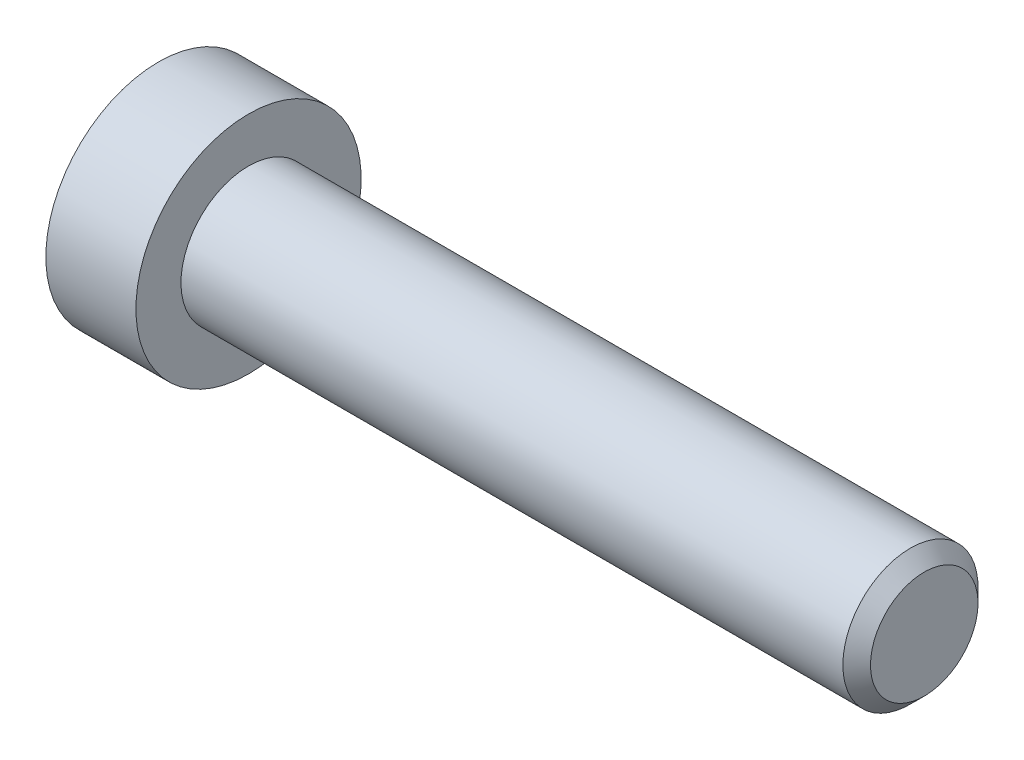
ISO-10303-21;
HEADER;
FILE_DESCRIPTION(('STEP AP214'),'2;1');
FILE_NAME('part.step','',(''),(''),'','','');
FILE_SCHEMA(('AUTOMOTIVE_DESIGN { 1 0 10303 214 1 1 1 1 }'));
ENDSEC;
DATA;
#1=APPLICATION_CONTEXT('core data for automotive mechanical design processes');
#2=APPLICATION_PROTOCOL_DEFINITION('international standard','automotive_design',2000,#1);
#3=PRODUCT_CONTEXT('',#1,'mechanical');
#4=PRODUCT('Part','Part','',(#3));
#5=PRODUCT_RELATED_PRODUCT_CATEGORY('part','',(#4));
#6=PRODUCT_DEFINITION_FORMATION('','',#4);
#7=PRODUCT_DEFINITION_CONTEXT('part definition',#1,'design');
#8=PRODUCT_DEFINITION('design','',#6,#7);
#9=PRODUCT_DEFINITION_SHAPE('','',#8);
#10=(LENGTH_UNIT() NAMED_UNIT(*) SI_UNIT(.MILLI.,.METRE.));
#11=(NAMED_UNIT(*) PLANE_ANGLE_UNIT() SI_UNIT($,.RADIAN.));
#12=(NAMED_UNIT(*) SI_UNIT($,.STERADIAN.) SOLID_ANGLE_UNIT());
#13=UNCERTAINTY_MEASURE_WITH_UNIT(LENGTH_MEASURE(1.E-05),#10,'distance_accuracy_value','');
#14=(GEOMETRIC_REPRESENTATION_CONTEXT(3) GLOBAL_UNCERTAINTY_ASSIGNED_CONTEXT((#13)) GLOBAL_UNIT_ASSIGNED_CONTEXT((#10,
#11,#12)) REPRESENTATION_CONTEXT('',''));
#15=CARTESIAN_POINT('',(0.,0.,0.));
#16=DIRECTION('',(0.,0.,1.));
#17=DIRECTION('',(1.,0.,0.));
#18=AXIS2_PLACEMENT_3D('',#15,#16,#17);
#19=CARTESIAN_POINT('',(0.999999999066858,0.,0.));
#20=DIRECTION('',(-1.,0.,0.));
#21=DIRECTION('',(0.,0.,1.));
#22=AXIS2_PLACEMENT_3D('',#19,#20,#21);
#23=CONICAL_SURFACE('',#22,1.49999999950978,1.04719755001518);
#24=CARTESIAN_POINT('',(1.86602540486547,1.13686837721616E-10,0.));
#25=VERTEX_POINT('',#24);
#26=VERTEX_LOOP('',#25);
#27=FACE_BOUND('',#26,.T.);
#28=CARTESIAN_POINT('',(1.,0.,0.));
#29=DIRECTION('',(1.,0.,0.));
#30=DIRECTION('',(0.,1.,0.));
#31=AXIS2_PLACEMENT_3D('',#28,#29,#30);
#32=CIRCLE('',#31,1.5);
#33=CARTESIAN_POINT('',(1.,1.5,0.));
#34=VERTEX_POINT('',#33);
#35=EDGE_CURVE('E102',#34,#34,#32,.F.);
#36=ORIENTED_EDGE('',*,*,#35,.T.);
#37=EDGE_LOOP('',(#36));
#38=FACE_BOUND('',#37,.T.);
#39=ADVANCED_FACE('F15',(#27,#38),#23,.F.);
#40=CARTESIAN_POINT('',(0.150320631441119,0.,0.));
#41=DIRECTION('',(1.,0.,0.));
#42=DIRECTION('',(0.,1.,0.));
#43=AXIS2_PLACEMENT_3D('',#40,#41,#42);
#44=CYLINDRICAL_SURFACE('',#43,1.5);
#45=ORIENTED_EDGE('',*,*,#35,.F.);
#46=EDGE_LOOP('',(#45));
#47=FACE_BOUND('',#46,.T.);
#48=CARTESIAN_POINT('',(-0.699358736312661,0.,0.));
#49=DIRECTION('',(-1.,0.,0.));
#50=DIRECTION('',(0.,1.,0.));
#51=AXIS2_PLACEMENT_3D('',#48,#49,#50);
#52=CIRCLE('',#51,1.50000000047612);
#53=CARTESIAN_POINT('',(-0.699358736312661,1.50000000047612,0.));
#54=VERTEX_POINT('',#53);
#55=EDGE_CURVE('E83',#54,#54,#52,.T.);
#56=ORIENTED_EDGE('',*,*,#55,.T.);
#57=EDGE_LOOP('',(#56));
#58=FACE_BOUND('',#57,.T.);
#59=ADVANCED_FACE('F152',(#47,#58),#44,.F.);
#60=CARTESIAN_POINT('',(-1.50480384832008,0.,0.));
#61=DIRECTION('',(-1.,0.,0.));
#62=DIRECTION('',(0.,0.,1.));
#63=AXIS2_PLACEMENT_3D('',#60,#61,#62);
#64=CONICAL_SURFACE('',#63,2.89507185334514,1.04719755001073);
#65=ORIENTED_EDGE('',*,*,#55,.F.);
#66=EDGE_LOOP('',(#65));
#67=FACE_BOUND('',#66,.T.);
#68=CARTESIAN_POINT('',(-1.50000000090994,2.50000000020726,1.44337567271138));
#69=CARTESIAN_POINT('',(-1.46336943230046,2.50000000007444,1.31652043381892));
#70=CARTESIAN_POINT('',(-1.4300558472106,2.50000000001995,1.18857018231563));
#71=CARTESIAN_POINT('',(-1.37190798495513,2.49999999998001,0.930454306290177));
#72=CARTESIAN_POINT('',(-1.34709427605387,2.49999999999471,0.800284097041287));
#73=CARTESIAN_POINT('',(-1.30846994921723,2.50000000000517,0.541556812697644));
#74=CARTESIAN_POINT('',(-1.29440223500533,2.50000000000138,0.413039534960997));
#75=CARTESIAN_POINT('',(-1.27761146065546,2.49999999999863,0.155400578725887));
#76=CARTESIAN_POINT('',(-1.27487449296861,2.49999999999966,0.0262798360324409));
#77=CARTESIAN_POINT('',(-1.28058286324248,2.5000000000003,-0.214968419856101));
#78=CARTESIAN_POINT('',(-1.28762660709737,2.50000000000009,-0.327132134317981));
#79=CARTESIAN_POINT('',(-1.30994662654135,2.49999999999992,-0.550728853225329));
#80=CARTESIAN_POINT('',(-1.32523051914313,2.49999999999998,-0.662161084886667));
#81=CARTESIAN_POINT('',(-1.36343729244334,2.50000000000003,-0.886218434121961));
#82=CARTESIAN_POINT('',(-1.38652205359365,2.50000000000002,-0.998815208519759));
#83=CARTESIAN_POINT('',(-1.43891470197747,2.49999999999999,-1.22232986213441));
#84=CARTESIAN_POINT('',(-1.46821028692561,2.49999999999998,-1.33325060262345));
#85=CARTESIAN_POINT('',(-1.50000000104471,2.5,-1.44337567270819));
#86=B_SPLINE_CURVE_WITH_KNOTS('',3,(#68,#69,#70,#71,#72,#73,#74,#75,#76,#77,#78,#79,#80,#81,#82,
#83,#84,#85),.UNSPECIFIED.,.F.,.F.,(4,2,2,2,2,2,2,2,4),(0.,0.39627001456981,0.793492271541644,
1.18088450803327,1.56780111154381,1.9046347285053,2.2417802422547,2.58640202794493,
2.93034746654568),.UNSPECIFIED.);
#87=CARTESIAN_POINT('',(-1.5000000010352,2.4999999998706,1.44337567289935));
#88=VERTEX_POINT('',#87);
#89=CARTESIAN_POINT('',(-1.50000000107833,2.5,-1.44337567282465));
#90=VERTEX_POINT('',#89);
#91=EDGE_CURVE('E18',#88,#90,#86,.T.);
#92=ORIENTED_EDGE('',*,*,#91,.T.);
#93=CARTESIAN_POINT('',(-1.50000000090994,2.49999999987614,-1.4433756732849));
#94=CARTESIAN_POINT('',(-1.46336943230046,2.39014014032572,-1.5068032926161));
#95=CARTESIAN_POINT('',(-1.4300558472106,2.27933197207602,-1.57077841832056));
#96=CARTESIAN_POINT('',(-1.37190798495513,2.05579706629793,-1.69983635629869));
#97=CARTESIAN_POINT('',(-1.34709427605387,1.9430663582798,-1.76492146093587));
#98=CARTESIAN_POINT('',(-1.30846994921723,1.71900195739128,-1.89428510311675));
#99=CARTESIAN_POINT('',(-1.29440223500533,1.60770273004423,-1.95854374198179));
#100=CARTESIAN_POINT('',(-1.27761146065546,1.38458084893874,-2.08736322009696));
#101=CARTESIAN_POINT('',(-1.27487449296861,1.27275900561122,-2.15192359144458));
#102=CARTESIAN_POINT('',(-1.28058286324248,1.06383188739337,-2.27254771938941));
#103=CARTESIAN_POINT('',(-1.28762660709736,0.966695261286451,-2.32862957662016));
#104=CARTESIAN_POINT('',(-1.30994662654135,0.773054822509758,-2.44042793607369));
#105=CARTESIAN_POINT('',(-1.32523051914313,0.676551679090675,-2.49614405190441));
#106=CARTESIAN_POINT('',(-1.36343729244334,0.482512322748331,-2.6081727265221));
#107=CARTESIAN_POINT('',(-1.38652205359365,0.385000655735647,-2.66447111372099));
#108=CARTESIAN_POINT('',(-1.43891470197746,0.191431287587271,-2.77622844052829));
#109=CARTESIAN_POINT('',(-1.4682102869256,0.095371108517176,-2.8316888107728));
#110=CARTESIAN_POINT('',(-1.50000000104471,2.30253922132991E-10,-2.88675134581519));
#111=B_SPLINE_CURVE_WITH_KNOTS('',3,(#93,#94,#95,#96,#97,#98,#99,#100,#101,#102,#103,#104,#105,
#106,#107,#108,#109,#110),.UNSPECIFIED.,.F.,.F.,(4,2,2,2,2,2,2,2,4),(0.,0.39627001456981,
0.793492271541645,1.18088450803327,1.56780111154381,1.9046347285053,2.2417802422547,
2.58640202794493,2.93034746654569),.UNSPECIFIED.);
#112=CARTESIAN_POINT('',(-1.5000000010352,0.,-2.88675134579871));
#113=VERTEX_POINT('',#112);
#114=EDGE_CURVE('E107',#90,#113,#111,.T.);
#115=ORIENTED_EDGE('',*,*,#114,.T.);
#116=CARTESIAN_POINT('',(-1.50000000090994,-3.3111445711247E-10,-2.88675134599628));
#117=CARTESIAN_POINT('',(-1.46336943230046,-0.109859859748714,-2.82332372643503));
#118=CARTESIAN_POINT('',(-1.4300558472106,-0.220668027943928,-2.75934860063619));
#119=CARTESIAN_POINT('',(-1.37190798495513,-0.444202933682073,-2.63029066258887));
#120=CARTESIAN_POINT('',(-1.34709427605387,-0.5569336417149,-2.56520555797716));
#121=CARTESIAN_POINT('',(-1.30846994921723,-0.780998042613884,-2.43584191581439));
#122=CARTESIAN_POINT('',(-1.29440223500533,-0.892297269957147,-2.37158327694279));
#123=CARTESIAN_POINT('',(-1.27761146065546,-1.11541915105988,-2.24276379882285));
#124=CARTESIAN_POINT('',(-1.27487449296861,-1.22724099438844,-2.17820342747702));
#125=CARTESIAN_POINT('',(-1.28058286324248,-1.43616811260693,-2.05757929953331));
#126=CARTESIAN_POINT('',(-1.28762660709736,-1.53330473871363,-2.00149744230218));
#127=CARTESIAN_POINT('',(-1.30994662654135,-1.72694517749016,-1.88969908284837));
#128=CARTESIAN_POINT('',(-1.32523051914313,-1.8234483209093,-1.83398296701775));
#129=CARTESIAN_POINT('',(-1.36343729244334,-2.01748767725169,-1.72195429240014));
#130=CARTESIAN_POINT('',(-1.38652205359365,-2.11499934426437,-1.66565590520123));
#131=CARTESIAN_POINT('',(-1.43891470197746,-2.30856871241272,-1.55389857839388));
#132=CARTESIAN_POINT('',(-1.4682102869256,-2.4046288914828,-1.49843820814935));
#133=CARTESIAN_POINT('',(-1.50000000104471,-2.49999999976975,-1.443375673107));
#134=B_SPLINE_CURVE_WITH_KNOTS('',3,(#116,#117,#118,#119,#120,#121,#122,#123,#124,#125,#126,
#127,#128,#129,#130,#131,#132,#133),.UNSPECIFIED.,.F.,.F.,(4,2,2,2,2,2,2,2,4),(0.,
0.396270014569809,0.793492271541644,1.18088450803327,1.56780111154381,1.9046347285053,
2.2417802422547,2.58640202794493,2.93034746654569),.UNSPECIFIED.);
#135=CARTESIAN_POINT('',(-1.5000000010352,-2.4999999998706,-1.44337567289936));
#136=VERTEX_POINT('',#135);
#137=EDGE_CURVE('E141',#113,#136,#134,.T.);
#138=ORIENTED_EDGE('',*,*,#137,.T.);
#139=CARTESIAN_POINT('',(-1.50000000090994,-2.50000000020726,-1.44337567271139));
#140=CARTESIAN_POINT('',(-1.46336943230046,-2.50000000007444,-1.31652043381893));
#141=CARTESIAN_POINT('',(-1.4300558472106,-2.50000000001995,-1.18857018231564));
#142=CARTESIAN_POINT('',(-1.37190798495513,-2.49999999998,-0.930454306290184));
#143=CARTESIAN_POINT('',(-1.34709427605387,-2.49999999999471,-0.800284097041294));
#144=CARTESIAN_POINT('',(-1.30846994921723,-2.50000000000516,-0.541556812697651));
#145=CARTESIAN_POINT('',(-1.29440223500533,-2.50000000000138,-0.413039534961004));
#146=CARTESIAN_POINT('',(-1.27761146065546,-2.49999999999863,-0.155400578725895));
#147=CARTESIAN_POINT('',(-1.27487449296861,-2.49999999999966,-0.0262798360324483));
#148=CARTESIAN_POINT('',(-1.28058286324248,-2.5000000000003,0.214968419856093));
#149=CARTESIAN_POINT('',(-1.28762660709736,-2.50000000000008,0.327132134317974));
#150=CARTESIAN_POINT('',(-1.30994662654135,-2.49999999999992,0.550728853225323));
#151=CARTESIAN_POINT('',(-1.32523051914313,-2.49999999999998,0.662161084886662));
#152=CARTESIAN_POINT('',(-1.36343729244334,-2.50000000000002,0.886218434121957));
#153=CARTESIAN_POINT('',(-1.38652205359365,-2.50000000000001,0.998815208519755));
#154=CARTESIAN_POINT('',(-1.43891470197746,-2.49999999999999,1.2223298621344));
#155=CARTESIAN_POINT('',(-1.4682102869256,-2.49999999999998,1.33325060262344));
#156=CARTESIAN_POINT('',(-1.50000000104471,-2.5,1.44337567270819));
#157=B_SPLINE_CURVE_WITH_KNOTS('',3,(#139,#140,#141,#142,#143,#144,#145,#146,#147,#148,#149,
#150,#151,#152,#153,#154,#155,#156),.UNSPECIFIED.,.F.,.F.,(4,2,2,2,2,2,2,2,4),(0.,
0.396270014569809,0.793492271541644,1.18088450803327,1.56780111154381,1.9046347285053,
2.2417802422547,2.58640202794493,2.93034746654569),.UNSPECIFIED.);
#158=CARTESIAN_POINT('',(-1.5000000010352,-2.4999999998706,1.44337567289936));
#159=VERTEX_POINT('',#158);
#160=EDGE_CURVE('E165',#136,#159,#157,.T.);
#161=ORIENTED_EDGE('',*,*,#160,.T.);
#162=CARTESIAN_POINT('',(-1.50000000090994,-2.49999999987614,1.44337567328489));
#163=CARTESIAN_POINT('',(-1.46336943230046,-2.39014014032572,1.5068032926161));
#164=CARTESIAN_POINT('',(-1.4300558472106,-2.27933197207602,1.57077841832055));
#165=CARTESIAN_POINT('',(-1.37190798495513,-2.05579706629793,1.69983635629869));
#166=CARTESIAN_POINT('',(-1.34709427605387,-1.9430663582798,1.76492146093586));
#167=CARTESIAN_POINT('',(-1.30846994921723,-1.71900195739128,1.89428510311674));
#168=CARTESIAN_POINT('',(-1.29440223500533,-1.60770273004423,1.95854374198179));
#169=CARTESIAN_POINT('',(-1.27761146065546,-1.38458084893874,2.08736322009696));
#170=CARTESIAN_POINT('',(-1.27487449296861,-1.27275900561122,2.15192359144457));
#171=CARTESIAN_POINT('',(-1.28058286324248,-1.06383188739337,2.2725477193894));
#172=CARTESIAN_POINT('',(-1.28762660709736,-0.966695261286452,2.32862957662015));
#173=CARTESIAN_POINT('',(-1.30994662654135,-0.773054822509759,2.44042793607369));
#174=CARTESIAN_POINT('',(-1.32523051914313,-0.676551679090675,2.49614405190441));
#175=CARTESIAN_POINT('',(-1.36343729244334,-0.482512322748331,2.6081727265221));
#176=CARTESIAN_POINT('',(-1.38652205359365,-0.385000655735646,2.66447111372098));
#177=CARTESIAN_POINT('',(-1.43891470197746,-0.19143128758727,2.77622844052829));
#178=CARTESIAN_POINT('',(-1.4682102869256,-0.0953711085171749,2.8316888107728));
#179=CARTESIAN_POINT('',(-1.50000000104471,-2.30252668835411E-10,2.88675134581519));
#180=B_SPLINE_CURVE_WITH_KNOTS('',3,(#162,#163,#164,#165,#166,#167,#168,#169,#170,#171,#172,
#173,#174,#175,#176,#177,#178,#179),.UNSPECIFIED.,.F.,.F.,(4,2,2,2,2,2,2,2,4),(0.,
0.396270014569809,0.793492271541644,1.18088450803327,1.56780111154381,1.9046347285053,
2.2417802422547,2.58640202794493,2.93034746654569),.UNSPECIFIED.);
#181=CARTESIAN_POINT('',(-1.5000000010352,0.,2.88675134579871));
#182=VERTEX_POINT('',#181);
#183=EDGE_CURVE('E88',#159,#182,#180,.T.);
#184=ORIENTED_EDGE('',*,*,#183,.T.);
#185=CARTESIAN_POINT('',(-1.50000000090994,3.31115352737197E-10,2.88675134599628));
#186=CARTESIAN_POINT('',(-1.46336943230046,0.109859859748716,2.82332372643503));
#187=CARTESIAN_POINT('',(-1.4300558472106,0.220668027943929,2.75934860063619));
#188=CARTESIAN_POINT('',(-1.37190798495513,0.444202933682074,2.63029066258887));
#189=CARTESIAN_POINT('',(-1.34709427605387,0.556933641714901,2.56520555797716));
#190=CARTESIAN_POINT('',(-1.30846994921723,0.780998042613885,2.43584191581439));
#191=CARTESIAN_POINT('',(-1.29440223500533,0.892297269957148,2.37158327694279));
#192=CARTESIAN_POINT('',(-1.27761146065546,1.11541915105988,2.24276379882285));
#193=CARTESIAN_POINT('',(-1.27487449296861,1.22724099438844,2.17820342747702));
#194=CARTESIAN_POINT('',(-1.28058286324248,1.43616811260693,2.05757929953331));
#195=CARTESIAN_POINT('',(-1.28762660709736,1.53330473871363,2.00149744230218));
#196=CARTESIAN_POINT('',(-1.30994662654135,1.72694517749016,1.88969908284836));
#197=CARTESIAN_POINT('',(-1.32523051914313,1.8234483209093,1.83398296701774));
#198=CARTESIAN_POINT('',(-1.36343729244334,2.01748767725169,1.72195429240013));
#199=CARTESIAN_POINT('',(-1.38652205359365,2.11499934426437,1.66565590520122));
#200=CARTESIAN_POINT('',(-1.43891470197746,2.30856871241272,1.55389857839388));
#201=CARTESIAN_POINT('',(-1.4682102869256,2.40462889148281,1.49843820814935));
#202=CARTESIAN_POINT('',(-1.50000000104471,2.49999999976975,1.44337567310699));
#203=B_SPLINE_CURVE_WITH_KNOTS('',3,(#185,#186,#187,#188,#189,#190,#191,#192,#193,#194,#195,
#196,#197,#198,#199,#200,#201,#202),.UNSPECIFIED.,.F.,.F.,(4,2,2,2,2,2,2,2,4),(0.,
0.39627001456981,0.793492271541644,1.18088450803327,1.56780111154381,1.9046347285053,
2.2417802422547,2.58640202794494,2.9303474665457),.UNSPECIFIED.);
#204=EDGE_CURVE('E85',#182,#88,#203,.T.);
#205=ORIENTED_EDGE('',*,*,#204,.T.);
#206=EDGE_LOOP('',(#92,#115,#138,#161,#184,#205));
#207=FACE_BOUND('',#206,.T.);
#208=ADVANCED_FACE('F86',(#67,#207),#64,.F.);
#209=CARTESIAN_POINT('',(-3.99999999999999,2.5,1.44337567297406));
#210=DIRECTION('',(0.,1.,0.));
#211=DIRECTION('',(0.,0.,1.));
#212=AXIS2_PLACEMENT_3D('',#209,#210,#211);
#213=PLANE('',#212);
#214=DIRECTION('',(1.,0.,0.));
#215=VECTOR('',#214,1.);
#216=CARTESIAN_POINT('',(-3.99999999999999,2.5,1.44337567297406));
#217=LINE('',#216,#215);
#218=CARTESIAN_POINT('',(-3.99999999999999,2.5,1.44337567297406));
#219=VERTEX_POINT('',#218);
#220=EDGE_CURVE('E76',#88,#219,#217,.F.);
#221=ORIENTED_EDGE('',*,*,#220,.T.);
#222=DIRECTION('',(0.,0.,1.));
#223=VECTOR('',#222,1.);
#224=CARTESIAN_POINT('',(-3.99999999999999,2.5,0.));
#225=LINE('',#224,#223);
#226=CARTESIAN_POINT('',(-3.99999999999999,2.5,-1.44337567297407));
#227=VERTEX_POINT('',#226);
#228=EDGE_CURVE('E105',#227,#219,#225,.T.);
#229=ORIENTED_EDGE('',*,*,#228,.F.);
#230=DIRECTION('',(1.,0.,0.));
#231=VECTOR('',#230,1.);
#232=CARTESIAN_POINT('',(-3.99999999999999,2.5,-1.44337567297407));
#233=LINE('',#232,#231);
#234=EDGE_CURVE('E79',#227,#90,#233,.T.);
#235=ORIENTED_EDGE('',*,*,#234,.T.);
#236=ORIENTED_EDGE('',*,*,#91,.F.);
#237=EDGE_LOOP('',(#221,#229,#235,#236));
#238=FACE_BOUND('',#237,.T.);
#239=ADVANCED_FACE('F73',(#238),#213,.F.);
#240=CARTESIAN_POINT('',(-3.99999999999999,0.,2.88675134594813));
#241=DIRECTION('',(0.,0.500000000000001,0.866025403784438));
#242=DIRECTION('',(0.,-0.866025403784438,0.500000000000001));
#243=AXIS2_PLACEMENT_3D('',#240,#241,#242);
#244=PLANE('',#243);
#245=DIRECTION('',(1.,0.,0.));
#246=VECTOR('',#245,1.);
#247=CARTESIAN_POINT('',(-3.99999999999999,0.,2.88675134594813));
#248=LINE('',#247,#246);
#249=CARTESIAN_POINT('',(-3.99999999999999,0.,2.88675134594813));
#250=VERTEX_POINT('',#249);
#251=EDGE_CURVE('E91',#182,#250,#248,.F.);
#252=ORIENTED_EDGE('',*,*,#251,.T.);
#253=DIRECTION('',(0.,-0.866025403784438,0.500000000000001));
#254=VECTOR('',#253,1.);
#255=CARTESIAN_POINT('',(-3.99999999999999,2.5,1.44337567297406));
#256=LINE('',#255,#254);
#257=EDGE_CURVE('E94',#219,#250,#256,.T.);
#258=ORIENTED_EDGE('',*,*,#257,.F.);
#259=ORIENTED_EDGE('',*,*,#220,.F.);
#260=ORIENTED_EDGE('',*,*,#204,.F.);
#261=EDGE_LOOP('',(#252,#258,#259,#260));
#262=FACE_BOUND('',#261,.T.);
#263=ADVANCED_FACE('F92',(#262),#244,.F.);
#264=CARTESIAN_POINT('',(-3.99999999999999,-2.5,1.44337567297406));
#265=DIRECTION('',(0.,-0.5,0.866025403784439));
#266=DIRECTION('',(0.,-0.866025403784439,-0.5));
#267=AXIS2_PLACEMENT_3D('',#264,#265,#266);
#268=PLANE('',#267);
#269=DIRECTION('',(1.,0.,0.));
#270=VECTOR('',#269,1.);
#271=CARTESIAN_POINT('',(-3.99999999999999,-2.5,1.44337567297406));
#272=LINE('',#271,#270);
#273=CARTESIAN_POINT('',(-3.99999999999999,-2.5,1.44337567297407));
#274=VERTEX_POINT('',#273);
#275=EDGE_CURVE('E174',#159,#274,#272,.F.);
#276=ORIENTED_EDGE('',*,*,#275,.T.);
#277=DIRECTION('',(0.,-0.866025403784439,-0.5));
#278=VECTOR('',#277,1.);
#279=CARTESIAN_POINT('',(-3.99999999999999,0.,2.88675134594813));
#280=LINE('',#279,#278);
#281=EDGE_CURVE('E118',#250,#274,#280,.T.);
#282=ORIENTED_EDGE('',*,*,#281,.F.);
#283=ORIENTED_EDGE('',*,*,#251,.F.);
#284=ORIENTED_EDGE('',*,*,#183,.F.);
#285=EDGE_LOOP('',(#276,#282,#283,#284));
#286=FACE_BOUND('',#285,.T.);
#287=ADVANCED_FACE('F175',(#286),#268,.F.);
#288=CARTESIAN_POINT('',(-3.99999999999999,-2.5,-1.44337567297406));
#289=DIRECTION('',(0.,-1.,0.));
#290=DIRECTION('',(0.,0.,-1.));
#291=AXIS2_PLACEMENT_3D('',#288,#289,#290);
#292=PLANE('',#291);
#293=DIRECTION('',(1.,0.,0.));
#294=VECTOR('',#293,1.);
#295=CARTESIAN_POINT('',(-3.99999999999999,-2.5,-1.44337567297406));
#296=LINE('',#295,#294);
#297=CARTESIAN_POINT('',(-3.99999999999999,-2.5,-1.44337567297406));
#298=VERTEX_POINT('',#297);
#299=EDGE_CURVE('E226',#136,#298,#296,.F.);
#300=ORIENTED_EDGE('',*,*,#299,.T.);
#301=DIRECTION('',(0.,0.,1.));
#302=VECTOR('',#301,1.);
#303=CARTESIAN_POINT('',(-3.99999999999999,-2.5,0.));
#304=LINE('',#303,#302);
#305=EDGE_CURVE('E115',#274,#298,#304,.F.);
#306=ORIENTED_EDGE('',*,*,#305,.F.);
#307=ORIENTED_EDGE('',*,*,#275,.F.);
#308=ORIENTED_EDGE('',*,*,#160,.F.);
#309=EDGE_LOOP('',(#300,#306,#307,#308));
#310=FACE_BOUND('',#309,.T.);
#311=ADVANCED_FACE('F178',(#310),#292,.F.);
#312=CARTESIAN_POINT('',(-3.99999999999999,0.,-2.88675134594813));
#313=DIRECTION('',(0.,-0.5,-0.866025403784439));
#314=DIRECTION('',(0.,0.866025403784439,-0.5));
#315=AXIS2_PLACEMENT_3D('',#312,#313,#314);
#316=PLANE('',#315);
#317=DIRECTION('',(1.,0.,0.));
#318=VECTOR('',#317,1.);
#319=CARTESIAN_POINT('',(-3.99999999999999,0.,-2.88675134594813));
#320=LINE('',#319,#318);
#321=CARTESIAN_POINT('',(-3.99999999999999,0.,-2.88675134594813));
#322=VERTEX_POINT('',#321);
#323=EDGE_CURVE('E38',#113,#322,#320,.F.);
#324=ORIENTED_EDGE('',*,*,#323,.T.);
#325=DIRECTION('',(0.,0.866025403784439,-0.5));
#326=VECTOR('',#325,1.);
#327=CARTESIAN_POINT('',(-3.99999999999999,-2.5,-1.44337567297406));
#328=LINE('',#327,#326);
#329=EDGE_CURVE('E112',#298,#322,#328,.T.);
#330=ORIENTED_EDGE('',*,*,#329,.F.);
#331=ORIENTED_EDGE('',*,*,#299,.F.);
#332=ORIENTED_EDGE('',*,*,#137,.F.);
#333=EDGE_LOOP('',(#324,#330,#331,#332));
#334=FACE_BOUND('',#333,.T.);
#335=ADVANCED_FACE('F217',(#334),#316,.F.);
#336=CARTESIAN_POINT('',(-3.99999999999999,2.5,-1.44337567297407));
#337=DIRECTION('',(0.,0.5,-0.866025403784439));
#338=DIRECTION('',(0.,0.866025403784439,0.5));
#339=AXIS2_PLACEMENT_3D('',#336,#337,#338);
#340=PLANE('',#339);
#341=ORIENTED_EDGE('',*,*,#234,.F.);
#342=DIRECTION('',(0.,0.866025403784439,0.5));
#343=VECTOR('',#342,1.);
#344=CARTESIAN_POINT('',(-3.99999999999999,0.,-2.88675134594813));
#345=LINE('',#344,#343);
#346=EDGE_CURVE('E108',#322,#227,#345,.T.);
#347=ORIENTED_EDGE('',*,*,#346,.F.);
#348=ORIENTED_EDGE('',*,*,#323,.F.);
#349=ORIENTED_EDGE('',*,*,#114,.F.);
#350=EDGE_LOOP('',(#341,#347,#348,#349));
#351=FACE_BOUND('',#350,.T.);
#352=ADVANCED_FACE('F147',(#351),#340,.F.);
#353=CARTESIAN_POINT('',(-3.99999999999999,3.94337567297406,0.));
#354=DIRECTION('',(-1.,0.,0.));
#355=DIRECTION('',(0.,0.,1.));
#356=AXIS2_PLACEMENT_3D('',#353,#354,#355);
#357=PLANE('',#356);
#358=ORIENTED_EDGE('',*,*,#329,.T.);
#359=ORIENTED_EDGE('',*,*,#346,.T.);
#360=ORIENTED_EDGE('',*,*,#228,.T.);
#361=ORIENTED_EDGE('',*,*,#257,.T.);
#362=ORIENTED_EDGE('',*,*,#281,.T.);
#363=ORIENTED_EDGE('',*,*,#305,.T.);
#364=EDGE_LOOP('',(#358,#359,#360,#361,#362,#363));
#365=FACE_BOUND('',#364,.T.);
#366=CARTESIAN_POINT('',(-3.99999999999999,0.,0.));
#367=DIRECTION('',(1.,0.,0.));
#368=DIRECTION('',(0.,1.,0.));
#369=AXIS2_PLACEMENT_3D('',#366,#367,#368);
#370=CIRCLE('',#369,5.);
#371=CARTESIAN_POINT('',(-3.99999999999999,5.,0.));
#372=VERTEX_POINT('',#371);
#373=EDGE_CURVE('E111',#372,#372,#370,.T.);
#374=ORIENTED_EDGE('',*,*,#373,.F.);
#375=EDGE_LOOP('',(#374));
#376=FACE_BOUND('',#375,.T.);
#377=ADVANCED_FACE('F210',(#365,#376),#357,.T.);
#378=CARTESIAN_POINT('',(-2.,0.,0.));
#379=DIRECTION('',(1.,0.,0.));
#380=DIRECTION('',(0.,1.,0.));
#381=AXIS2_PLACEMENT_3D('',#378,#379,#380);
#382=CYLINDRICAL_SURFACE('',#381,5.);
#383=ORIENTED_EDGE('',*,*,#373,.T.);
#384=EDGE_LOOP('',(#383));
#385=FACE_BOUND('',#384,.T.);
#386=CARTESIAN_POINT('',(0.,0.,0.));
#387=DIRECTION('',(1.,0.,0.));
#388=DIRECTION('',(0.,1.,0.));
#389=AXIS2_PLACEMENT_3D('',#386,#387,#388);
#390=CIRCLE('',#389,5.);
#391=CARTESIAN_POINT('',(0.,5.,0.));
#392=VERTEX_POINT('',#391);
#393=EDGE_CURVE('E131',#392,#392,#390,.T.);
#394=ORIENTED_EDGE('',*,*,#393,.F.);
#395=EDGE_LOOP('',(#394));
#396=FACE_BOUND('',#395,.T.);
#397=ADVANCED_FACE('F207',(#385,#396),#382,.T.);
#398=CARTESIAN_POINT('',(30.,1.5,0.));
#399=DIRECTION('',(1.,0.,0.));
#400=DIRECTION('',(0.,0.,-1.));
#401=AXIS2_PLACEMENT_3D('',#398,#399,#400);
#402=PLANE('',#401);
#403=CARTESIAN_POINT('',(30.0000000003138,0.,0.));
#404=DIRECTION('',(-1.,0.,0.));
#405=DIRECTION('',(0.,0.,1.));
#406=AXIS2_PLACEMENT_3D('',#403,#404,#405);
#407=CIRCLE('',#406,2.38655000021026);
#408=CARTESIAN_POINT('',(30.0000000003138,0.,2.38655000021026));
#409=VERTEX_POINT('',#408);
#410=EDGE_CURVE('E128',#409,#409,#407,.T.);
#411=ORIENTED_EDGE('',*,*,#410,.F.);
#412=EDGE_LOOP('',(#411));
#413=FACE_BOUND('',#412,.T.);
#414=ADVANCED_FACE('F203',(#413),#402,.T.);
#415=CARTESIAN_POINT('',(0.,4.,0.));
#416=DIRECTION('',(1.,0.,0.));
#417=DIRECTION('',(0.,0.,-1.));
#418=AXIS2_PLACEMENT_3D('',#415,#416,#417);
#419=PLANE('',#418);
#420=CARTESIAN_POINT('',(0.,0.,0.));
#421=DIRECTION('',(1.,0.,0.));
#422=DIRECTION('',(0.,1.,0.));
#423=AXIS2_PLACEMENT_3D('',#420,#421,#422);
#424=CIRCLE('',#423,3.);
#425=CARTESIAN_POINT('',(0.,3.,0.));
#426=VERTEX_POINT('',#425);
#427=EDGE_CURVE('E29',#426,#426,#424,.T.);
#428=ORIENTED_EDGE('',*,*,#427,.F.);
#429=EDGE_LOOP('',(#428));
#430=FACE_BOUND('',#429,.T.);
#431=ORIENTED_EDGE('',*,*,#393,.T.);
#432=EDGE_LOOP('',(#431));
#433=FACE_BOUND('',#432,.T.);
#434=ADVANCED_FACE('F196',(#430,#433),#419,.T.);
#435=CARTESIAN_POINT('',(29.3865499997423,0.,0.));
#436=DIRECTION('',(-1.,0.,0.));
#437=DIRECTION('',(0.,0.,1.));
#438=AXIS2_PLACEMENT_3D('',#435,#436,#437);
#439=CONICAL_SURFACE('',#438,2.99999999970169,0.785398162517161);
#440=ORIENTED_EDGE('',*,*,#410,.T.);
#441=EDGE_LOOP('',(#440));
#442=FACE_BOUND('',#441,.T.);
#443=CARTESIAN_POINT('',(29.38655,0.,0.));
#444=DIRECTION('',(1.,0.,0.));
#445=DIRECTION('',(0.,1.,0.));
#446=AXIS2_PLACEMENT_3D('',#443,#444,#445);
#447=CIRCLE('',#446,3.);
#448=CARTESIAN_POINT('',(29.38655,3.,0.));
#449=VERTEX_POINT('',#448);
#450=EDGE_CURVE('E9',#449,#449,#447,.F.);
#451=ORIENTED_EDGE('',*,*,#450,.F.);
#452=EDGE_LOOP('',(#451));
#453=FACE_BOUND('',#452,.T.);
#454=ADVANCED_FACE('F189',(#442,#453),#439,.T.);
#455=CARTESIAN_POINT('',(15.,0.,0.));
#456=DIRECTION('',(1.,0.,0.));
#457=DIRECTION('',(0.,1.,0.));
#458=AXIS2_PLACEMENT_3D('',#455,#456,#457);
#459=CYLINDRICAL_SURFACE('',#458,3.);
#460=ORIENTED_EDGE('',*,*,#450,.T.);
#461=EDGE_LOOP('',(#460));
#462=FACE_BOUND('',#461,.T.);
#463=ORIENTED_EDGE('',*,*,#427,.T.);
#464=EDGE_LOOP('',(#463));
#465=FACE_BOUND('',#464,.T.);
#466=ADVANCED_FACE('F187',(#462,#465),#459,.T.);
#467=CLOSED_SHELL('',(#39,#59,#208,#239,#263,#287,#311,#335,#352,#377,#397,#414,#434,#454,#466));
#468=MANIFOLD_SOLID_BREP('B1',#467);
#469=ADVANCED_BREP_SHAPE_REPRESENTATION('',(#18,#468),#14);
#470=SHAPE_DEFINITION_REPRESENTATION(#9,#469);
ENDSEC;
END-ISO-10303-21;
